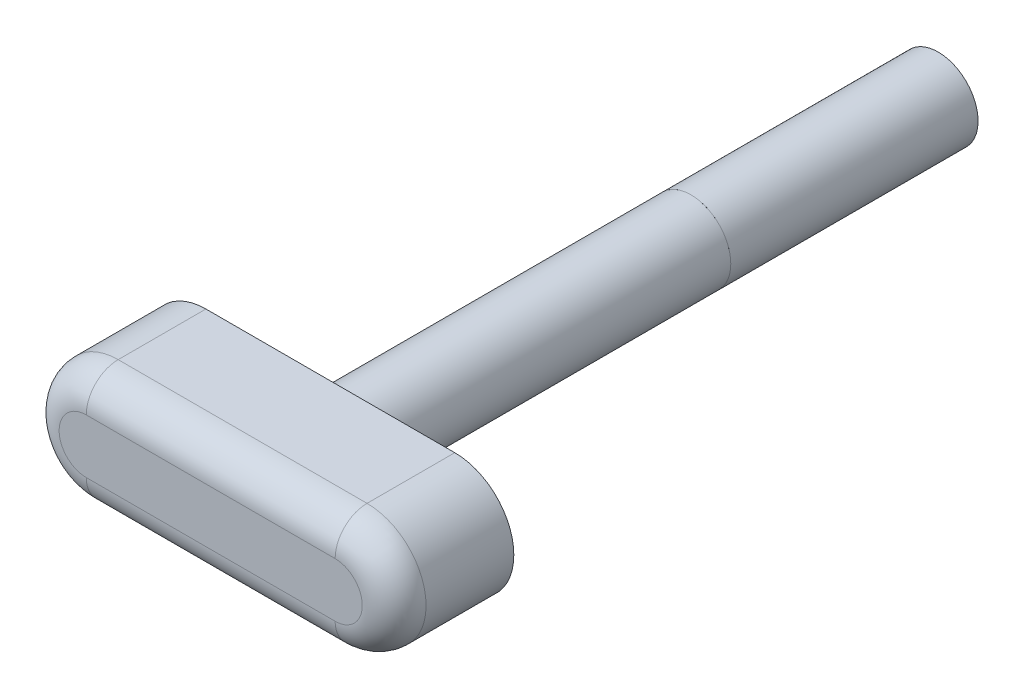
ISO-10303-21;
HEADER;
FILE_DESCRIPTION(('STEP AP214'),'2;1');
FILE_NAME('part.step','',(''),(''),'','','');
FILE_SCHEMA(('AUTOMOTIVE_DESIGN { 1 0 10303 214 1 1 1 1 }'));
ENDSEC;
DATA;
#1=APPLICATION_CONTEXT('core data for automotive mechanical design processes');
#2=APPLICATION_PROTOCOL_DEFINITION('international standard','automotive_design',2000,#1);
#3=PRODUCT_CONTEXT('',#1,'mechanical');
#4=PRODUCT('Part','Part','',(#3));
#5=PRODUCT_RELATED_PRODUCT_CATEGORY('part','',(#4));
#6=PRODUCT_DEFINITION_FORMATION('','',#4);
#7=PRODUCT_DEFINITION_CONTEXT('part definition',#1,'design');
#8=PRODUCT_DEFINITION('design','',#6,#7);
#9=PRODUCT_DEFINITION_SHAPE('','',#8);
#10=(LENGTH_UNIT() NAMED_UNIT(*) SI_UNIT(.MILLI.,.METRE.));
#11=(NAMED_UNIT(*) PLANE_ANGLE_UNIT() SI_UNIT($,.RADIAN.));
#12=(NAMED_UNIT(*) SI_UNIT($,.STERADIAN.) SOLID_ANGLE_UNIT());
#13=UNCERTAINTY_MEASURE_WITH_UNIT(LENGTH_MEASURE(1.E-05),#10,'distance_accuracy_value','');
#14=(GEOMETRIC_REPRESENTATION_CONTEXT(3) GLOBAL_UNCERTAINTY_ASSIGNED_CONTEXT((#13)) GLOBAL_UNIT_ASSIGNED_CONTEXT((#10,
#11,#12)) REPRESENTATION_CONTEXT('',''));
#15=CARTESIAN_POINT('',(0.,0.,0.));
#16=DIRECTION('',(0.,0.,1.));
#17=DIRECTION('',(1.,0.,0.));
#18=AXIS2_PLACEMENT_3D('',#15,#16,#17);
#19=CARTESIAN_POINT('',(0.,136.1,161.9));
#20=DIRECTION('',(0.,0.,1.));
#21=DIRECTION('',(1.,0.,0.));
#22=AXIS2_PLACEMENT_3D('',#19,#20,#21);
#23=CYLINDRICAL_SURFACE('',#22,2.5);
#24=CARTESIAN_POINT('',(0.,136.1,161.9));
#25=DIRECTION('',(0.,0.,-1.));
#26=DIRECTION('',(-1.,0.,0.));
#27=AXIS2_PLACEMENT_3D('',#24,#25,#26);
#28=CIRCLE('',#27,2.5);
#29=CARTESIAN_POINT('',(-2.5,136.1,161.9));
#30=VERTEX_POINT('',#29);
#31=EDGE_CURVE('E13',#30,#30,#28,.T.);
#32=ORIENTED_EDGE('',*,*,#31,.F.);
#33=EDGE_LOOP('',(#32));
#34=FACE_BOUND('',#33,.T.);
#35=CARTESIAN_POINT('',(0.,136.1,177.4));
#36=DIRECTION('',(0.,0.,-1.));
#37=DIRECTION('',(-1.,0.,0.));
#38=AXIS2_PLACEMENT_3D('',#35,#36,#37);
#39=CIRCLE('',#38,2.5);
#40=CARTESIAN_POINT('',(-2.5,136.1,177.4));
#41=VERTEX_POINT('',#40);
#42=EDGE_CURVE('E443',#41,#41,#39,.T.);
#43=ORIENTED_EDGE('',*,*,#42,.T.);
#44=EDGE_LOOP('',(#43));
#45=FACE_BOUND('',#44,.T.);
#46=ADVANCED_FACE('F440',(#34,#45),#23,.T.);
#47=CARTESIAN_POINT('',(0.,0.,161.9));
#48=DIRECTION('',(0.,0.,-1.));
#49=DIRECTION('',(-1.,0.,0.));
#50=AXIS2_PLACEMENT_3D('',#47,#48,#49);
#51=PLANE('',#50);
#52=ORIENTED_EDGE('',*,*,#31,.T.);
#53=EDGE_LOOP('',(#52));
#54=FACE_BOUND('',#53,.T.);
#55=ADVANCED_FACE('F455',(#54),#51,.T.);
#56=CARTESIAN_POINT('',(0.,0.,177.4));
#57=DIRECTION('',(0.,0.,-1.));
#58=DIRECTION('',(-1.,0.,0.));
#59=AXIS2_PLACEMENT_3D('',#56,#57,#58);
#60=PLANE('',#59);
#61=ORIENTED_EDGE('',*,*,#42,.F.);
#62=EDGE_LOOP('',(#61));
#63=FACE_BOUND('',#62,.T.);
#64=ADVANCED_FACE('F453',(#63),#60,.F.);
#65=CLOSED_SHELL('',(#46,#55,#64));
#66=MANIFOLD_SOLID_BREP('B2',#65);
#67=CARTESIAN_POINT('',(-7.8,132.4,207.5));
#68=DIRECTION('',(0.,1.,0.));
#69=DIRECTION('',(0.,0.,1.));
#70=AXIS2_PLACEMENT_3D('',#67,#68,#69);
#71=PLANE('',#70);
#72=DIRECTION('',(0.,0.,-1.));
#73=VECTOR('',#72,1.);
#74=CARTESIAN_POINT('',(7.8,132.4,207.5));
#75=LINE('',#74,#73);
#76=CARTESIAN_POINT('',(7.8,132.4,205.5));
#77=VERTEX_POINT('',#76);
#78=CARTESIAN_POINT('',(7.8,132.4,200.));
#79=VERTEX_POINT('',#78);
#80=EDGE_CURVE('E536',#77,#79,#75,.T.);
#81=ORIENTED_EDGE('',*,*,#80,.F.);
#82=DIRECTION('',(1.,0.,0.));
#83=VECTOR('',#82,1.);
#84=CARTESIAN_POINT('',(-7.8,132.4,205.5));
#85=LINE('',#84,#83);
#86=CARTESIAN_POINT('',(-7.8,132.4,205.5));
#87=VERTEX_POINT('',#86);
#88=EDGE_CURVE('E581',#77,#87,#85,.F.);
#89=ORIENTED_EDGE('',*,*,#88,.T.);
#90=DIRECTION('',(0.,0.,-1.));
#91=VECTOR('',#90,1.);
#92=CARTESIAN_POINT('',(-7.8,132.4,207.5));
#93=LINE('',#92,#91);
#94=CARTESIAN_POINT('',(-7.8,132.4,200.));
#95=VERTEX_POINT('',#94);
#96=EDGE_CURVE('E556',#87,#95,#93,.T.);
#97=ORIENTED_EDGE('',*,*,#96,.T.);
#98=DIRECTION('',(1.,0.,0.));
#99=VECTOR('',#98,1.);
#100=CARTESIAN_POINT('',(-7.8,132.4,200.));
#101=LINE('',#100,#99);
#102=EDGE_CURVE('E551',#95,#79,#101,.T.);
#103=ORIENTED_EDGE('',*,*,#102,.T.);
#104=EDGE_LOOP('',(#81,#89,#97,#103));
#105=FACE_BOUND('',#104,.T.);
#106=ADVANCED_FACE('F483',(#105),#71,.F.);
#107=CARTESIAN_POINT('',(7.8,136.1,207.5));
#108=DIRECTION('',(0.,0.,-1.));
#109=DIRECTION('',(-1.,0.,0.));
#110=AXIS2_PLACEMENT_3D('',#107,#108,#109);
#111=CYLINDRICAL_SURFACE('',#110,3.70000000000001);
#112=DIRECTION('',(0.,0.,-1.));
#113=VECTOR('',#112,1.);
#114=CARTESIAN_POINT('',(7.8,139.8,207.5));
#115=LINE('',#114,#113);
#116=CARTESIAN_POINT('',(7.8,139.8,205.5));
#117=VERTEX_POINT('',#116);
#118=CARTESIAN_POINT('',(7.8,139.8,200.));
#119=VERTEX_POINT('',#118);
#120=EDGE_CURVE('E545',#117,#119,#115,.T.);
#121=ORIENTED_EDGE('',*,*,#120,.F.);
#122=CARTESIAN_POINT('',(7.8,136.1,205.5));
#123=DIRECTION('',(0.,0.,1.));
#124=DIRECTION('',(1.,0.,0.));
#125=AXIS2_PLACEMENT_3D('',#122,#123,#124);
#126=CIRCLE('',#125,3.70000000000001);
#127=EDGE_CURVE('E506',#117,#77,#126,.F.);
#128=ORIENTED_EDGE('',*,*,#127,.T.);
#129=ORIENTED_EDGE('',*,*,#80,.T.);
#130=CARTESIAN_POINT('',(7.8,136.1,200.));
#131=DIRECTION('',(0.,0.,1.));
#132=DIRECTION('',(1.,0.,0.));
#133=AXIS2_PLACEMENT_3D('',#130,#131,#132);
#134=CIRCLE('',#133,3.70000000000001);
#135=EDGE_CURVE('E539',#79,#119,#134,.T.);
#136=ORIENTED_EDGE('',*,*,#135,.T.);
#137=EDGE_LOOP('',(#121,#128,#129,#136));
#138=FACE_BOUND('',#137,.T.);
#139=ADVANCED_FACE('F538',(#138),#111,.T.);
#140=CARTESIAN_POINT('',(7.8,139.8,207.5));
#141=DIRECTION('',(0.,-1.,0.));
#142=DIRECTION('',(0.,0.,-1.));
#143=AXIS2_PLACEMENT_3D('',#140,#141,#142);
#144=PLANE('',#143);
#145=DIRECTION('',(0.,0.,-1.));
#146=VECTOR('',#145,1.);
#147=CARTESIAN_POINT('',(-7.8,139.8,207.5));
#148=LINE('',#147,#146);
#149=CARTESIAN_POINT('',(-7.8,139.8,205.5));
#150=VERTEX_POINT('',#149);
#151=CARTESIAN_POINT('',(-7.8,139.8,200.));
#152=VERTEX_POINT('',#151);
#153=EDGE_CURVE('E567',#150,#152,#148,.T.);
#154=ORIENTED_EDGE('',*,*,#153,.F.);
#155=DIRECTION('',(-1.,0.,0.));
#156=VECTOR('',#155,1.);
#157=CARTESIAN_POINT('',(7.8,139.8,205.5));
#158=LINE('',#157,#156);
#159=EDGE_CURVE('E492',#150,#117,#158,.F.);
#160=ORIENTED_EDGE('',*,*,#159,.T.);
#161=ORIENTED_EDGE('',*,*,#120,.T.);
#162=DIRECTION('',(-1.,0.,0.));
#163=VECTOR('',#162,1.);
#164=CARTESIAN_POINT('',(7.8,139.8,200.));
#165=LINE('',#164,#163);
#166=EDGE_CURVE('E553',#119,#152,#165,.T.);
#167=ORIENTED_EDGE('',*,*,#166,.T.);
#168=EDGE_LOOP('',(#154,#160,#161,#167));
#169=FACE_BOUND('',#168,.T.);
#170=ADVANCED_FACE('F608',(#169),#144,.F.);
#171=CARTESIAN_POINT('',(-7.8,136.1,207.5));
#172=DIRECTION('',(0.,0.,-1.));
#173=DIRECTION('',(-1.,0.,0.));
#174=AXIS2_PLACEMENT_3D('',#171,#172,#173);
#175=CYLINDRICAL_SURFACE('',#174,3.70000000000001);
#176=ORIENTED_EDGE('',*,*,#96,.F.);
#177=CARTESIAN_POINT('',(-7.8,136.1,205.5));
#178=DIRECTION('',(0.,0.,1.));
#179=DIRECTION('',(1.,0.,0.));
#180=AXIS2_PLACEMENT_3D('',#177,#178,#179);
#181=CIRCLE('',#180,3.70000000000001);
#182=EDGE_CURVE('E578',#87,#150,#181,.F.);
#183=ORIENTED_EDGE('',*,*,#182,.T.);
#184=ORIENTED_EDGE('',*,*,#153,.T.);
#185=CARTESIAN_POINT('',(-7.8,136.1,200.));
#186=DIRECTION('',(0.,0.,1.));
#187=DIRECTION('',(1.,0.,0.));
#188=AXIS2_PLACEMENT_3D('',#185,#186,#187);
#189=CIRCLE('',#188,3.70000000000001);
#190=EDGE_CURVE('E564',#152,#95,#189,.T.);
#191=ORIENTED_EDGE('',*,*,#190,.T.);
#192=EDGE_LOOP('',(#176,#183,#184,#191));
#193=FACE_BOUND('',#192,.T.);
#194=ADVANCED_FACE('F607',(#193),#175,.T.);
#195=CARTESIAN_POINT('',(7.8,136.1,207.5));
#196=DIRECTION('',(0.,0.,1.));
#197=DIRECTION('',(1.,0.,0.));
#198=AXIS2_PLACEMENT_3D('',#195,#196,#197);
#199=PLANE('',#198);
#200=DIRECTION('',(-1.,0.,0.));
#201=VECTOR('',#200,1.);
#202=CARTESIAN_POINT('',(-7.8,137.8,207.5));
#203=LINE('',#202,#201);
#204=CARTESIAN_POINT('',(7.8,137.8,207.5));
#205=VERTEX_POINT('',#204);
#206=CARTESIAN_POINT('',(-7.8,137.8,207.5));
#207=VERTEX_POINT('',#206);
#208=EDGE_CURVE('E544',#205,#207,#203,.T.);
#209=ORIENTED_EDGE('',*,*,#208,.T.);
#210=CARTESIAN_POINT('',(-7.8,136.1,207.5));
#211=DIRECTION('',(0.,0.,1.));
#212=DIRECTION('',(1.,0.,0.));
#213=AXIS2_PLACEMENT_3D('',#210,#211,#212);
#214=CIRCLE('',#213,1.70000000000001);
#215=CARTESIAN_POINT('',(-7.8,134.4,207.5));
#216=VERTEX_POINT('',#215);
#217=EDGE_CURVE('E575',#207,#216,#214,.T.);
#218=ORIENTED_EDGE('',*,*,#217,.T.);
#219=DIRECTION('',(1.,0.,0.));
#220=VECTOR('',#219,1.);
#221=CARTESIAN_POINT('',(7.8,134.4,207.5));
#222=LINE('',#221,#220);
#223=CARTESIAN_POINT('',(7.8,134.4,207.5));
#224=VERTEX_POINT('',#223);
#225=EDGE_CURVE('E573',#216,#224,#222,.T.);
#226=ORIENTED_EDGE('',*,*,#225,.T.);
#227=CARTESIAN_POINT('',(7.8,136.1,207.5));
#228=DIRECTION('',(0.,0.,1.));
#229=DIRECTION('',(1.,0.,0.));
#230=AXIS2_PLACEMENT_3D('',#227,#228,#229);
#231=CIRCLE('',#230,1.70000000000001);
#232=EDGE_CURVE('E571',#224,#205,#231,.T.);
#233=ORIENTED_EDGE('',*,*,#232,.T.);
#234=EDGE_LOOP('',(#209,#218,#226,#233));
#235=FACE_BOUND('',#234,.T.);
#236=ADVANCED_FACE('F600',(#235),#199,.T.);
#237=CARTESIAN_POINT('',(7.8,136.1,200.));
#238=DIRECTION('',(0.,0.,1.));
#239=DIRECTION('',(1.,0.,0.));
#240=AXIS2_PLACEMENT_3D('',#237,#238,#239);
#241=PLANE('',#240);
#242=CARTESIAN_POINT('',(0.,136.1,200.));
#243=DIRECTION('',(0.,0.,1.));
#244=DIRECTION('',(1.,0.,0.));
#245=AXIS2_PLACEMENT_3D('',#242,#243,#244);
#246=CIRCLE('',#245,2.5);
#247=CARTESIAN_POINT('',(2.5,136.1,200.));
#248=VERTEX_POINT('',#247);
#249=EDGE_CURVE('E438',#248,#248,#246,.F.);
#250=ORIENTED_EDGE('',*,*,#249,.F.);
#251=EDGE_LOOP('',(#250));
#252=FACE_BOUND('',#251,.T.);
#253=ORIENTED_EDGE('',*,*,#102,.F.);
#254=ORIENTED_EDGE('',*,*,#190,.F.);
#255=ORIENTED_EDGE('',*,*,#166,.F.);
#256=ORIENTED_EDGE('',*,*,#135,.F.);
#257=EDGE_LOOP('',(#253,#254,#255,#256));
#258=FACE_BOUND('',#257,.T.);
#259=ADVANCED_FACE('F549',(#252,#258),#241,.F.);
#260=CARTESIAN_POINT('',(7.8,136.1,205.5));
#261=DIRECTION('',(0.,0.,1.));
#262=DIRECTION('',(1.,0.,0.));
#263=AXIS2_PLACEMENT_3D('',#260,#261,#262);
#264=DEGENERATE_TOROIDAL_SURFACE('',#263,1.70000000000001,2.,.T.);
#265=CARTESIAN_POINT('',(7.8,134.4,205.5));
#266=DIRECTION('',(-1.,0.,0.));
#267=DIRECTION('',(0.,0.,1.));
#268=AXIS2_PLACEMENT_3D('',#265,#266,#267);
#269=CIRCLE('',#268,2.);
#270=EDGE_CURVE('E560',#77,#224,#269,.T.);
#271=ORIENTED_EDGE('',*,*,#270,.F.);
#272=ORIENTED_EDGE('',*,*,#127,.F.);
#273=CARTESIAN_POINT('',(7.8,137.8,205.5));
#274=DIRECTION('',(-1.,0.,0.));
#275=DIRECTION('',(0.,0.,1.));
#276=AXIS2_PLACEMENT_3D('',#273,#274,#275);
#277=CIRCLE('',#276,2.);
#278=EDGE_CURVE('E487',#205,#117,#277,.T.);
#279=ORIENTED_EDGE('',*,*,#278,.F.);
#280=ORIENTED_EDGE('',*,*,#232,.F.);
#281=EDGE_LOOP('',(#271,#272,#279,#280));
#282=FACE_BOUND('',#281,.T.);
#283=ADVANCED_FACE('F485',(#282),#264,.T.);
#284=CARTESIAN_POINT('',(7.8,137.8,205.5));
#285=DIRECTION('',(1.,0.,0.));
#286=DIRECTION('',(0.,0.,-1.));
#287=AXIS2_PLACEMENT_3D('',#284,#285,#286);
#288=CYLINDRICAL_SURFACE('',#287,2.);
#289=ORIENTED_EDGE('',*,*,#278,.T.);
#290=ORIENTED_EDGE('',*,*,#159,.F.);
#291=CARTESIAN_POINT('',(-7.8,137.8,205.5));
#292=DIRECTION('',(-1.,0.,0.));
#293=DIRECTION('',(0.,0.,1.));
#294=AXIS2_PLACEMENT_3D('',#291,#292,#293);
#295=CIRCLE('',#294,2.);
#296=EDGE_CURVE('E587',#207,#150,#295,.T.);
#297=ORIENTED_EDGE('',*,*,#296,.F.);
#298=ORIENTED_EDGE('',*,*,#208,.F.);
#299=EDGE_LOOP('',(#289,#290,#297,#298));
#300=FACE_BOUND('',#299,.T.);
#301=ADVANCED_FACE('F626',(#300),#288,.T.);
#302=CARTESIAN_POINT('',(7.8,134.4,205.5));
#303=DIRECTION('',(-1.,0.,0.));
#304=DIRECTION('',(0.,0.,1.));
#305=AXIS2_PLACEMENT_3D('',#302,#303,#304);
#306=CYLINDRICAL_SURFACE('',#305,2.);
#307=ORIENTED_EDGE('',*,*,#270,.T.);
#308=ORIENTED_EDGE('',*,*,#225,.F.);
#309=CARTESIAN_POINT('',(-7.8,134.4,205.5));
#310=DIRECTION('',(-1.,0.,0.));
#311=DIRECTION('',(0.,0.,1.));
#312=AXIS2_PLACEMENT_3D('',#309,#310,#311);
#313=CIRCLE('',#312,2.);
#314=EDGE_CURVE('E585',#87,#216,#313,.T.);
#315=ORIENTED_EDGE('',*,*,#314,.F.);
#316=ORIENTED_EDGE('',*,*,#88,.F.);
#317=EDGE_LOOP('',(#307,#308,#315,#316));
#318=FACE_BOUND('',#317,.T.);
#319=ADVANCED_FACE('F593',(#318),#306,.T.);
#320=CARTESIAN_POINT('',(-7.8,136.1,205.5));
#321=DIRECTION('',(0.,0.,1.));
#322=DIRECTION('',(1.,0.,0.));
#323=AXIS2_PLACEMENT_3D('',#320,#321,#322);
#324=DEGENERATE_TOROIDAL_SURFACE('',#323,1.70000000000001,2.,.T.);
#325=ORIENTED_EDGE('',*,*,#296,.T.);
#326=ORIENTED_EDGE('',*,*,#182,.F.);
#327=ORIENTED_EDGE('',*,*,#314,.T.);
#328=ORIENTED_EDGE('',*,*,#217,.F.);
#329=EDGE_LOOP('',(#325,#326,#327,#328));
#330=FACE_BOUND('',#329,.T.);
#331=ADVANCED_FACE('F604',(#330),#324,.T.);
#332=CARTESIAN_POINT('',(0.,136.1,207.071067811866));
#333=DIRECTION('',(0.,0.,-1.));
#334=DIRECTION('',(-1.,0.,0.));
#335=AXIS2_PLACEMENT_3D('',#332,#333,#334);
#336=CYLINDRICAL_SURFACE('',#335,2.5);
#337=CARTESIAN_POINT('',(0.,136.1,177.4));
#338=DIRECTION('',(0.,0.,1.));
#339=DIRECTION('',(1.,0.,0.));
#340=AXIS2_PLACEMENT_3D('',#337,#338,#339);
#341=CIRCLE('',#340,2.5);
#342=CARTESIAN_POINT('',(2.5,136.1,177.4));
#343=VERTEX_POINT('',#342);
#344=EDGE_CURVE('E588',#343,#343,#341,.F.);
#345=ORIENTED_EDGE('',*,*,#344,.F.);
#346=EDGE_LOOP('',(#345));
#347=FACE_BOUND('',#346,.T.);
#348=ORIENTED_EDGE('',*,*,#249,.T.);
#349=EDGE_LOOP('',(#348));
#350=FACE_BOUND('',#349,.T.);
#351=ADVANCED_FACE('F624',(#347,#350),#336,.T.);
#352=CARTESIAN_POINT('',(0.,0.,177.4));
#353=DIRECTION('',(0.,0.,1.));
#354=DIRECTION('',(1.,0.,0.));
#355=AXIS2_PLACEMENT_3D('',#352,#353,#354);
#356=PLANE('',#355);
#357=ORIENTED_EDGE('',*,*,#344,.T.);
#358=EDGE_LOOP('',(#357));
#359=FACE_BOUND('',#358,.T.);
#360=ADVANCED_FACE('F645',(#359),#356,.F.);
#361=CLOSED_SHELL('',(#106,#139,#170,#194,#236,#259,#283,#301,#319,#331,#351,#360));
#362=MANIFOLD_SOLID_BREP('B8',#361);
#363=ADVANCED_BREP_SHAPE_REPRESENTATION('',(#18,#66,#362),#14);
#364=SHAPE_DEFINITION_REPRESENTATION(#9,#363);
ENDSEC;
END-ISO-10303-21;
